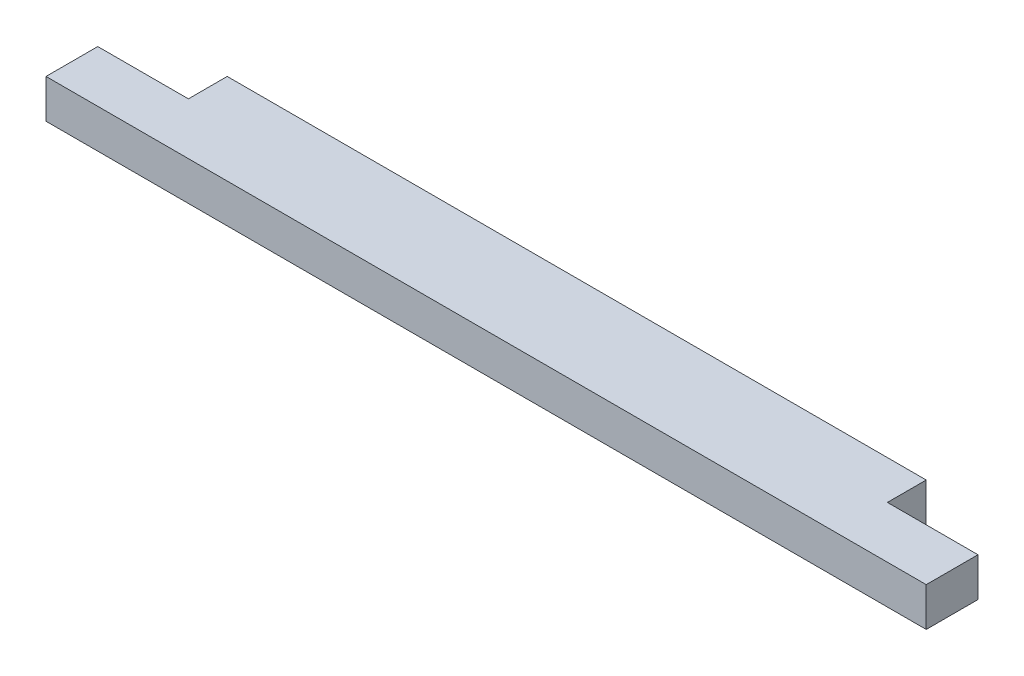
ISO-10303-21;
HEADER;
FILE_DESCRIPTION(('STEP AP214'),'2;1');
FILE_NAME('part.step','',(''),(''),'','','');
FILE_SCHEMA(('AUTOMOTIVE_DESIGN { 1 0 10303 214 1 1 1 1 }'));
ENDSEC;
DATA;
#1=APPLICATION_CONTEXT('core data for automotive mechanical design processes');
#2=APPLICATION_PROTOCOL_DEFINITION('international standard','automotive_design',2000,#1);
#3=PRODUCT_CONTEXT('',#1,'mechanical');
#4=PRODUCT('Part','Part','',(#3));
#5=PRODUCT_RELATED_PRODUCT_CATEGORY('part','',(#4));
#6=PRODUCT_DEFINITION_FORMATION('','',#4);
#7=PRODUCT_DEFINITION_CONTEXT('part definition',#1,'design');
#8=PRODUCT_DEFINITION('design','',#6,#7);
#9=PRODUCT_DEFINITION_SHAPE('','',#8);
#10=(LENGTH_UNIT() NAMED_UNIT(*) SI_UNIT(.MILLI.,.METRE.));
#11=(NAMED_UNIT(*) PLANE_ANGLE_UNIT() SI_UNIT($,.RADIAN.));
#12=(NAMED_UNIT(*) SI_UNIT($,.STERADIAN.) SOLID_ANGLE_UNIT());
#13=UNCERTAINTY_MEASURE_WITH_UNIT(LENGTH_MEASURE(1.E-05),#10,'distance_accuracy_value','');
#14=(GEOMETRIC_REPRESENTATION_CONTEXT(3) GLOBAL_UNCERTAINTY_ASSIGNED_CONTEXT((#13)) GLOBAL_UNIT_ASSIGNED_CONTEXT((#10,
#11,#12)) REPRESENTATION_CONTEXT('',''));
#15=CARTESIAN_POINT('',(0.,0.,0.));
#16=DIRECTION('',(0.,0.,1.));
#17=DIRECTION('',(1.,0.,0.));
#18=AXIS2_PLACEMENT_3D('',#15,#16,#17);
#19=CARTESIAN_POINT('',(0.,38.1,0.));
#20=DIRECTION('',(1.,0.,0.));
#21=DIRECTION('',(0.,0.,-1.));
#22=AXIS2_PLACEMENT_3D('',#19,#20,#21);
#23=PLANE('',#22);
#24=DIRECTION('',(0.,0.,1.));
#25=VECTOR('',#24,1.);
#26=CARTESIAN_POINT('',(0.,38.1,0.));
#27=LINE('',#26,#25);
#28=CARTESIAN_POINT('',(0.,38.1,-50.8));
#29=VERTEX_POINT('',#28);
#30=CARTESIAN_POINT('',(0.,38.1,0.));
#31=VERTEX_POINT('',#30);
#32=EDGE_CURVE('E117',#29,#31,#27,.T.);
#33=ORIENTED_EDGE('',*,*,#32,.F.);
#34=DIRECTION('',(0.,1.,0.));
#35=VECTOR('',#34,1.);
#36=CARTESIAN_POINT('',(0.,0.,-50.8));
#37=LINE('',#36,#35);
#38=CARTESIAN_POINT('',(0.,0.,-50.8));
#39=VERTEX_POINT('',#38);
#40=EDGE_CURVE('E105',#39,#29,#37,.T.);
#41=ORIENTED_EDGE('',*,*,#40,.F.);
#42=DIRECTION('',(0.,0.,1.));
#43=VECTOR('',#42,1.);
#44=CARTESIAN_POINT('',(0.,0.,0.));
#45=LINE('',#44,#43);
#46=CARTESIAN_POINT('',(0.,0.,0.));
#47=VERTEX_POINT('',#46);
#48=EDGE_CURVE('E115',#39,#47,#45,.T.);
#49=ORIENTED_EDGE('',*,*,#48,.T.);
#50=DIRECTION('',(0.,-1.,0.));
#51=VECTOR('',#50,1.);
#52=CARTESIAN_POINT('',(0.,38.1,0.));
#53=LINE('',#52,#51);
#54=EDGE_CURVE('E11',#31,#47,#53,.T.);
#55=ORIENTED_EDGE('',*,*,#54,.F.);
#56=EDGE_LOOP('',(#33,#41,#49,#55));
#57=FACE_BOUND('',#56,.T.);
#58=ADVANCED_FACE('F38',(#57),#23,.F.);
#59=CARTESIAN_POINT('',(0.,38.1,0.));
#60=DIRECTION('',(0.,0.,-1.));
#61=DIRECTION('',(-1.,0.,0.));
#62=AXIS2_PLACEMENT_3D('',#59,#60,#61);
#63=PLANE('',#62);
#64=DIRECTION('',(1.,0.,0.));
#65=VECTOR('',#64,1.);
#66=CARTESIAN_POINT('',(0.,0.,0.));
#67=LINE('',#66,#65);
#68=CARTESIAN_POINT('',(863.6,0.,0.));
#69=VERTEX_POINT('',#68);
#70=EDGE_CURVE('E121',#47,#69,#67,.T.);
#71=ORIENTED_EDGE('',*,*,#70,.T.);
#72=DIRECTION('',(0.,-1.,0.));
#73=VECTOR('',#72,1.);
#74=CARTESIAN_POINT('',(863.6,38.1,0.));
#75=LINE('',#74,#73);
#76=CARTESIAN_POINT('',(863.6,38.1,0.));
#77=VERTEX_POINT('',#76);
#78=EDGE_CURVE('E45',#77,#69,#75,.T.);
#79=ORIENTED_EDGE('',*,*,#78,.F.);
#80=DIRECTION('',(1.,0.,0.));
#81=VECTOR('',#80,1.);
#82=CARTESIAN_POINT('',(0.,38.1,0.));
#83=LINE('',#82,#81);
#84=EDGE_CURVE('E147',#31,#77,#83,.T.);
#85=ORIENTED_EDGE('',*,*,#84,.F.);
#86=ORIENTED_EDGE('',*,*,#54,.T.);
#87=EDGE_LOOP('',(#71,#79,#85,#86));
#88=FACE_BOUND('',#87,.T.);
#89=ADVANCED_FACE('F182',(#88),#63,.F.);
#90=CARTESIAN_POINT('',(863.6,38.1,0.));
#91=DIRECTION('',(-1.,0.,0.));
#92=DIRECTION('',(0.,0.,1.));
#93=AXIS2_PLACEMENT_3D('',#90,#91,#92);
#94=PLANE('',#93);
#95=DIRECTION('',(0.,0.,-1.));
#96=VECTOR('',#95,1.);
#97=CARTESIAN_POINT('',(863.6,0.,0.));
#98=LINE('',#97,#96);
#99=CARTESIAN_POINT('',(863.6,0.,-50.8));
#100=VERTEX_POINT('',#99);
#101=EDGE_CURVE('E124',#69,#100,#98,.T.);
#102=ORIENTED_EDGE('',*,*,#101,.T.);
#103=DIRECTION('',(0.,1.,0.));
#104=VECTOR('',#103,1.);
#105=CARTESIAN_POINT('',(863.6,0.,-50.8));
#106=LINE('',#105,#104);
#107=CARTESIAN_POINT('',(863.6,38.1,-50.8));
#108=VERTEX_POINT('',#107);
#109=EDGE_CURVE('E163',#100,#108,#106,.T.);
#110=ORIENTED_EDGE('',*,*,#109,.T.);
#111=DIRECTION('',(0.,0.,-1.));
#112=VECTOR('',#111,1.);
#113=CARTESIAN_POINT('',(863.6,38.1,0.));
#114=LINE('',#113,#112);
#115=EDGE_CURVE('E141',#77,#108,#114,.T.);
#116=ORIENTED_EDGE('',*,*,#115,.F.);
#117=ORIENTED_EDGE('',*,*,#78,.T.);
#118=EDGE_LOOP('',(#102,#110,#116,#117));
#119=FACE_BOUND('',#118,.T.);
#120=ADVANCED_FACE('F180',(#119),#94,.F.);
#121=CARTESIAN_POINT('',(0.,38.1,-88.9));
#122=DIRECTION('',(0.,0.,1.));
#123=DIRECTION('',(1.,0.,0.));
#124=AXIS2_PLACEMENT_3D('',#121,#122,#123);
#125=PLANE('',#124);
#126=DIRECTION('',(-1.,0.,0.));
#127=VECTOR('',#126,1.);
#128=CARTESIAN_POINT('',(0.,0.,-88.9));
#129=LINE('',#128,#127);
#130=CARTESIAN_POINT('',(774.7,0.,-88.9));
#131=VERTEX_POINT('',#130);
#132=CARTESIAN_POINT('',(88.9,0.,-88.8999999999999));
#133=VERTEX_POINT('',#132);
#134=EDGE_CURVE('E134',#131,#133,#129,.T.);
#135=ORIENTED_EDGE('',*,*,#134,.T.);
#136=DIRECTION('',(0.,1.,0.));
#137=VECTOR('',#136,1.);
#138=CARTESIAN_POINT('',(88.9,0.,-88.8999999999999));
#139=LINE('',#138,#137);
#140=CARTESIAN_POINT('',(88.9,38.1,-88.8999999999999));
#141=VERTEX_POINT('',#140);
#142=EDGE_CURVE('E122',#133,#141,#139,.T.);
#143=ORIENTED_EDGE('',*,*,#142,.T.);
#144=DIRECTION('',(-1.,0.,0.));
#145=VECTOR('',#144,1.);
#146=CARTESIAN_POINT('',(0.,38.1,-88.9));
#147=LINE('',#146,#145);
#148=CARTESIAN_POINT('',(774.7,38.1,-88.9));
#149=VERTEX_POINT('',#148);
#150=EDGE_CURVE('E129',#149,#141,#147,.T.);
#151=ORIENTED_EDGE('',*,*,#150,.F.);
#152=DIRECTION('',(0.,1.,0.));
#153=VECTOR('',#152,1.);
#154=CARTESIAN_POINT('',(774.7,0.,-88.9));
#155=LINE('',#154,#153);
#156=EDGE_CURVE('E157',#131,#149,#155,.T.);
#157=ORIENTED_EDGE('',*,*,#156,.F.);
#158=EDGE_LOOP('',(#135,#143,#151,#157));
#159=FACE_BOUND('',#158,.T.);
#160=ADVANCED_FACE('F175',(#159),#125,.F.);
#161=CARTESIAN_POINT('',(0.,38.1,0.));
#162=DIRECTION('',(0.,-1.,0.));
#163=DIRECTION('',(0.,0.,-1.));
#164=AXIS2_PLACEMENT_3D('',#161,#162,#163);
#165=PLANE('',#164);
#166=ORIENTED_EDGE('',*,*,#150,.T.);
#167=DIRECTION('',(0.,0.,-1.));
#168=VECTOR('',#167,1.);
#169=CARTESIAN_POINT('',(88.9,38.1,-88.8999999999999));
#170=LINE('',#169,#168);
#171=CARTESIAN_POINT('',(88.9,38.1,-50.7999999999999));
#172=VERTEX_POINT('',#171);
#173=EDGE_CURVE('E110',#172,#141,#170,.T.);
#174=ORIENTED_EDGE('',*,*,#173,.F.);
#175=DIRECTION('',(1.,0.,0.));
#176=VECTOR('',#175,1.);
#177=CARTESIAN_POINT('',(0.,38.1,-50.8));
#178=LINE('',#177,#176);
#179=EDGE_CURVE('E161',#29,#172,#178,.T.);
#180=ORIENTED_EDGE('',*,*,#179,.F.);
#181=ORIENTED_EDGE('',*,*,#32,.T.);
#182=ORIENTED_EDGE('',*,*,#84,.T.);
#183=ORIENTED_EDGE('',*,*,#115,.T.);
#184=DIRECTION('',(1.,0.,0.));
#185=VECTOR('',#184,1.);
#186=CARTESIAN_POINT('',(863.6,38.1,-50.8));
#187=LINE('',#186,#185);
#188=CARTESIAN_POINT('',(774.7,38.1,-50.8));
#189=VERTEX_POINT('',#188);
#190=EDGE_CURVE('E155',#189,#108,#187,.T.);
#191=ORIENTED_EDGE('',*,*,#190,.F.);
#192=DIRECTION('',(0.,0.,1.));
#193=VECTOR('',#192,1.);
#194=CARTESIAN_POINT('',(774.7,38.1,-88.9));
#195=LINE('',#194,#193);
#196=EDGE_CURVE('E158',#149,#189,#195,.T.);
#197=ORIENTED_EDGE('',*,*,#196,.F.);
#198=EDGE_LOOP('',(#166,#174,#180,#181,#182,#183,#191,#197));
#199=FACE_BOUND('',#198,.T.);
#200=ADVANCED_FACE('F178',(#199),#165,.F.);
#201=CARTESIAN_POINT('',(0.,0.,0.));
#202=DIRECTION('',(0.,-1.,0.));
#203=DIRECTION('',(0.,0.,-1.));
#204=AXIS2_PLACEMENT_3D('',#201,#202,#203);
#205=PLANE('',#204);
#206=DIRECTION('',(0.,0.,-1.));
#207=VECTOR('',#206,1.);
#208=CARTESIAN_POINT('',(88.9,0.,-88.8999999999999));
#209=LINE('',#208,#207);
#210=CARTESIAN_POINT('',(88.9,0.,-50.7999999999999));
#211=VERTEX_POINT('',#210);
#212=EDGE_CURVE('E52',#211,#133,#209,.T.);
#213=ORIENTED_EDGE('',*,*,#212,.T.);
#214=ORIENTED_EDGE('',*,*,#134,.F.);
#215=DIRECTION('',(0.,0.,1.));
#216=VECTOR('',#215,1.);
#217=CARTESIAN_POINT('',(774.7,0.,-88.9));
#218=LINE('',#217,#216);
#219=CARTESIAN_POINT('',(774.7,0.,-50.8));
#220=VERTEX_POINT('',#219);
#221=EDGE_CURVE('E152',#131,#220,#218,.T.);
#222=ORIENTED_EDGE('',*,*,#221,.T.);
#223=DIRECTION('',(1.,0.,0.));
#224=VECTOR('',#223,1.);
#225=CARTESIAN_POINT('',(863.6,0.,-50.8));
#226=LINE('',#225,#224);
#227=EDGE_CURVE('E60',#220,#100,#226,.T.);
#228=ORIENTED_EDGE('',*,*,#227,.T.);
#229=ORIENTED_EDGE('',*,*,#101,.F.);
#230=ORIENTED_EDGE('',*,*,#70,.F.);
#231=ORIENTED_EDGE('',*,*,#48,.F.);
#232=DIRECTION('',(1.,0.,0.));
#233=VECTOR('',#232,1.);
#234=CARTESIAN_POINT('',(0.,0.,-50.8));
#235=LINE('',#234,#233);
#236=EDGE_CURVE('E101',#39,#211,#235,.T.);
#237=ORIENTED_EDGE('',*,*,#236,.T.);
#238=EDGE_LOOP('',(#213,#214,#222,#228,#229,#230,#231,#237));
#239=FACE_BOUND('',#238,.T.);
#240=ADVANCED_FACE('F119',(#239),#205,.T.);
#241=CARTESIAN_POINT('',(863.6,0.,-50.8));
#242=DIRECTION('',(0.,0.,1.));
#243=DIRECTION('',(1.,0.,0.));
#244=AXIS2_PLACEMENT_3D('',#241,#242,#243);
#245=PLANE('',#244);
#246=ORIENTED_EDGE('',*,*,#190,.T.);
#247=ORIENTED_EDGE('',*,*,#109,.F.);
#248=ORIENTED_EDGE('',*,*,#227,.F.);
#249=DIRECTION('',(0.,1.,0.));
#250=VECTOR('',#249,1.);
#251=CARTESIAN_POINT('',(774.7,0.,-50.8));
#252=LINE('',#251,#250);
#253=EDGE_CURVE('E166',#220,#189,#252,.T.);
#254=ORIENTED_EDGE('',*,*,#253,.T.);
#255=EDGE_LOOP('',(#246,#247,#248,#254));
#256=FACE_BOUND('',#255,.T.);
#257=ADVANCED_FACE('F179',(#256),#245,.F.);
#258=CARTESIAN_POINT('',(774.7,0.,-88.9));
#259=DIRECTION('',(-1.,0.,0.));
#260=DIRECTION('',(0.,0.,1.));
#261=AXIS2_PLACEMENT_3D('',#258,#259,#260);
#262=PLANE('',#261);
#263=ORIENTED_EDGE('',*,*,#196,.T.);
#264=ORIENTED_EDGE('',*,*,#253,.F.);
#265=ORIENTED_EDGE('',*,*,#221,.F.);
#266=ORIENTED_EDGE('',*,*,#156,.T.);
#267=EDGE_LOOP('',(#263,#264,#265,#266));
#268=FACE_BOUND('',#267,.T.);
#269=ADVANCED_FACE('F177',(#268),#262,.F.);
#270=CARTESIAN_POINT('',(88.9,0.,-88.8999999999999));
#271=DIRECTION('',(1.,0.,0.));
#272=DIRECTION('',(0.,0.,-1.));
#273=AXIS2_PLACEMENT_3D('',#270,#271,#272);
#274=PLANE('',#273);
#275=ORIENTED_EDGE('',*,*,#173,.T.);
#276=ORIENTED_EDGE('',*,*,#142,.F.);
#277=ORIENTED_EDGE('',*,*,#212,.F.);
#278=DIRECTION('',(0.,1.,0.));
#279=VECTOR('',#278,1.);
#280=CARTESIAN_POINT('',(88.9,0.,-50.7999999999999));
#281=LINE('',#280,#279);
#282=EDGE_CURVE('E107',#211,#172,#281,.T.);
#283=ORIENTED_EDGE('',*,*,#282,.T.);
#284=EDGE_LOOP('',(#275,#276,#277,#283));
#285=FACE_BOUND('',#284,.T.);
#286=ADVANCED_FACE('F242',(#285),#274,.F.);
#287=CARTESIAN_POINT('',(0.,0.,-50.8));
#288=DIRECTION('',(0.,0.,1.));
#289=DIRECTION('',(1.,0.,0.));
#290=AXIS2_PLACEMENT_3D('',#287,#288,#289);
#291=PLANE('',#290);
#292=ORIENTED_EDGE('',*,*,#179,.T.);
#293=ORIENTED_EDGE('',*,*,#282,.F.);
#294=ORIENTED_EDGE('',*,*,#236,.F.);
#295=ORIENTED_EDGE('',*,*,#40,.T.);
#296=EDGE_LOOP('',(#292,#293,#294,#295));
#297=FACE_BOUND('',#296,.T.);
#298=ADVANCED_FACE('F104',(#297),#291,.F.);
#299=CLOSED_SHELL('',(#58,#89,#120,#160,#200,#240,#257,#269,#286,#298));
#300=MANIFOLD_SOLID_BREP('B2',#299);
#301=ADVANCED_BREP_SHAPE_REPRESENTATION('',(#18,#300),#14);
#302=SHAPE_DEFINITION_REPRESENTATION(#9,#301);
ENDSEC;
END-ISO-10303-21;
